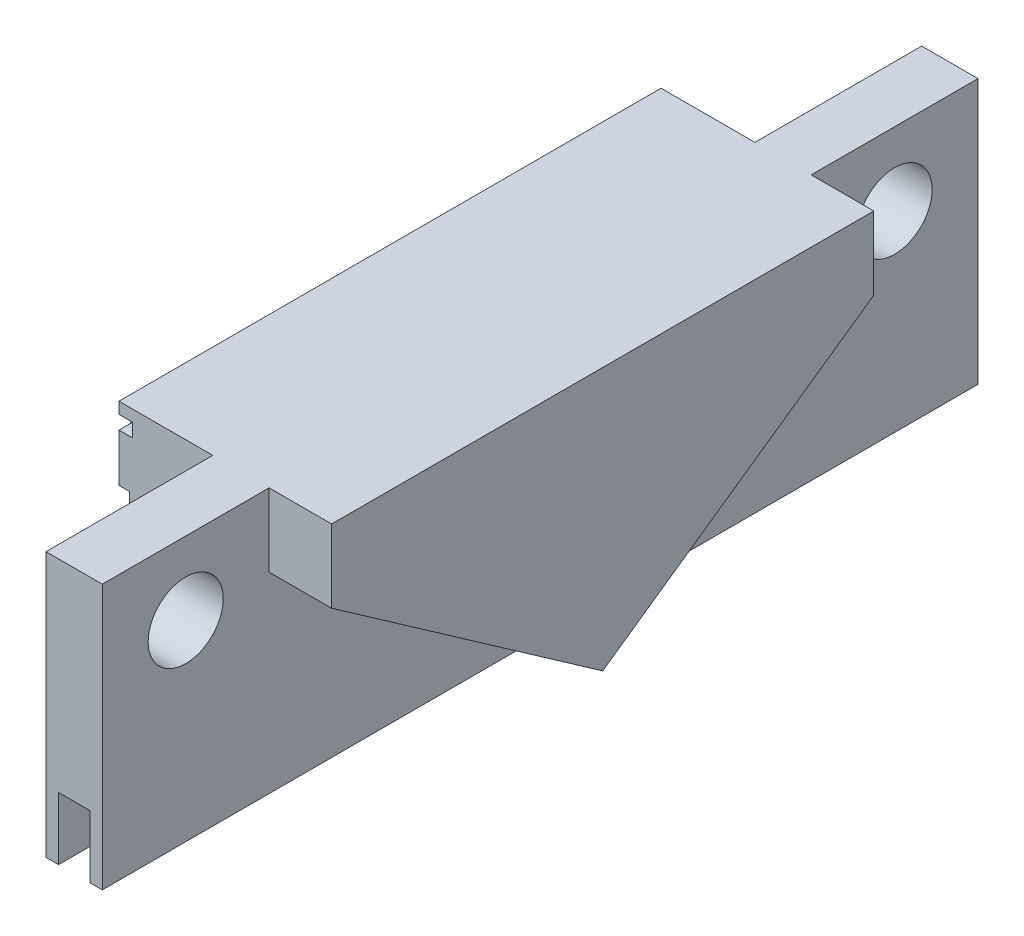
ISO-10303-21;
HEADER;
FILE_DESCRIPTION(('STEP AP214'),'2;1');
FILE_NAME('part.step','',(''),(''),'','','');
FILE_SCHEMA(('AUTOMOTIVE_DESIGN { 1 0 10303 214 1 1 1 1 }'));
ENDSEC;
DATA;
#1=APPLICATION_CONTEXT('core data for automotive mechanical design processes');
#2=APPLICATION_PROTOCOL_DEFINITION('international standard','automotive_design',2000,#1);
#3=PRODUCT_CONTEXT('',#1,'mechanical');
#4=PRODUCT('Part','Part','',(#3));
#5=PRODUCT_RELATED_PRODUCT_CATEGORY('part','',(#4));
#6=PRODUCT_DEFINITION_FORMATION('','',#4);
#7=PRODUCT_DEFINITION_CONTEXT('part definition',#1,'design');
#8=PRODUCT_DEFINITION('design','',#6,#7);
#9=PRODUCT_DEFINITION_SHAPE('','',#8);
#10=(LENGTH_UNIT() NAMED_UNIT(*) SI_UNIT(.MILLI.,.METRE.));
#11=(NAMED_UNIT(*) PLANE_ANGLE_UNIT() SI_UNIT($,.RADIAN.));
#12=(NAMED_UNIT(*) SI_UNIT($,.STERADIAN.) SOLID_ANGLE_UNIT());
#13=UNCERTAINTY_MEASURE_WITH_UNIT(LENGTH_MEASURE(1.E-05),#10,'distance_accuracy_value','');
#14=(GEOMETRIC_REPRESENTATION_CONTEXT(3) GLOBAL_UNCERTAINTY_ASSIGNED_CONTEXT((#13)) GLOBAL_UNIT_ASSIGNED_CONTEXT((#10,
#11,#12)) REPRESENTATION_CONTEXT('',''));
#15=CARTESIAN_POINT('',(0.,0.,0.));
#16=DIRECTION('',(0.,0.,1.));
#17=DIRECTION('',(1.,0.,0.));
#18=AXIS2_PLACEMENT_3D('',#15,#16,#17);
#19=CARTESIAN_POINT('',(0.,0.,0.));
#20=DIRECTION('',(0.,1.,0.));
#21=DIRECTION('',(0.,0.,1.));
#22=AXIS2_PLACEMENT_3D('',#19,#20,#21);
#23=PLANE('',#22);
#24=DIRECTION('',(0.,0.,1.));
#25=VECTOR('',#24,1.);
#26=CARTESIAN_POINT('',(-21.5781796503859,0.,0.));
#27=LINE('',#26,#25);
#28=CARTESIAN_POINT('',(-21.5781796503859,0.,-23.5441961802651));
#29=VERTEX_POINT('',#28);
#30=CARTESIAN_POINT('',(-21.5781796503859,0.,18.4558038197349));
#31=VERTEX_POINT('',#30);
#32=EDGE_CURVE('E426',#29,#31,#27,.T.);
#33=ORIENTED_EDGE('',*,*,#32,.T.);
#34=DIRECTION('',(1.,0.,0.));
#35=VECTOR('',#34,1.);
#36=CARTESIAN_POINT('',(0.,0.,18.4558038197349));
#37=LINE('',#36,#35);
#38=CARTESIAN_POINT('',(-22.1781796503859,0.,18.4558038197349));
#39=VERTEX_POINT('',#38);
#40=EDGE_CURVE('E326',#39,#31,#37,.T.);
#41=ORIENTED_EDGE('',*,*,#40,.F.);
#42=DIRECTION('',(0.,0.,1.));
#43=VECTOR('',#42,1.);
#44=CARTESIAN_POINT('',(-22.1781796503859,0.,4.45580381973494));
#45=LINE('',#44,#43);
#46=CARTESIAN_POINT('',(-22.1781796503859,0.,-23.5441961802651));
#47=VERTEX_POINT('',#46);
#48=EDGE_CURVE('E247',#47,#39,#45,.T.);
#49=ORIENTED_EDGE('',*,*,#48,.F.);
#50=DIRECTION('',(1.,0.,0.));
#51=VECTOR('',#50,1.);
#52=CARTESIAN_POINT('',(0.,0.,-23.5441961802651));
#53=LINE('',#52,#51);
#54=EDGE_CURVE('E440',#47,#29,#53,.T.);
#55=ORIENTED_EDGE('',*,*,#54,.T.);
#56=EDGE_LOOP('',(#33,#41,#49,#55));
#57=FACE_BOUND('',#56,.T.);
#58=ADVANCED_FACE('F45',(#57),#23,.F.);
#59=CARTESIAN_POINT('',(-28.7781796503859,-0.00999999999999959,18.4558038197349));
#60=DIRECTION('',(1.,0.,0.));
#61=DIRECTION('',(0.,0.,-1.));
#62=AXIS2_PLACEMENT_3D('',#59,#60,#61);
#63=PLANE('',#62);
#64=CARTESIAN_POINT('',(-28.7781796503859,9.2,-12.2941961802651));
#65=DIRECTION('',(1.,0.,0.));
#66=DIRECTION('',(0.,0.,-1.));
#67=AXIS2_PLACEMENT_3D('',#64,#65,#66);
#68=CIRCLE('',#67,1.6);
#69=CARTESIAN_POINT('',(-28.7781796503859,9.2,-13.8941961802651));
#70=VERTEX_POINT('',#69);
#71=EDGE_CURVE('E11',#70,#70,#68,.F.);
#72=ORIENTED_EDGE('',*,*,#71,.F.);
#73=EDGE_LOOP('',(#72));
#74=FACE_BOUND('',#73,.T.);
#75=DIRECTION('',(0.,-0.57357643635105,0.819152044288989));
#76=VECTOR('',#75,1.);
#77=CARTESIAN_POINT('',(-28.7781796503859,9.2,-15.5441961802651));
#78=LINE('',#77,#76);
#79=CARTESIAN_POINT('',(-28.7781796503859,9.2,-15.5441961802651));
#80=VERTEX_POINT('',#79);
#81=CARTESIAN_POINT('',(-28.7781796503859,0.0973020032736751,-2.54419618026506));
#82=VERTEX_POINT('',#81);
#83=EDGE_CURVE('E54',#80,#82,#78,.T.);
#84=ORIENTED_EDGE('',*,*,#83,.T.);
#85=DIRECTION('',(0.,-0.57357643635105,-0.819152044288989));
#86=VECTOR('',#85,1.);
#87=CARTESIAN_POINT('',(-28.7781796503859,9.2,10.4558038197349));
#88=LINE('',#87,#86);
#89=CARTESIAN_POINT('',(-28.7781796503859,9.2,10.4558038197349));
#90=VERTEX_POINT('',#89);
#91=EDGE_CURVE('E350',#90,#82,#88,.T.);
#92=ORIENTED_EDGE('',*,*,#91,.F.);
#93=DIRECTION('',(0.,-1.,0.));
#94=VECTOR('',#93,1.);
#95=CARTESIAN_POINT('',(-28.7781796503859,12.7,10.4558038197349));
#96=LINE('',#95,#94);
#97=CARTESIAN_POINT('',(-28.7781796503859,11.5,10.4558038197349));
#98=VERTEX_POINT('',#97);
#99=EDGE_CURVE('E346',#98,#90,#96,.T.);
#100=ORIENTED_EDGE('',*,*,#99,.F.);
#101=DIRECTION('',(0.,0.,-1.));
#102=VECTOR('',#101,1.);
#103=CARTESIAN_POINT('',(-28.7781796503859,11.5,10.4558038197349));
#104=LINE('',#103,#102);
#105=CARTESIAN_POINT('',(-28.7781796503859,11.5,0.455803819734919));
#106=VERTEX_POINT('',#105);
#107=EDGE_CURVE('E251',#98,#106,#104,.T.);
#108=ORIENTED_EDGE('',*,*,#107,.T.);
#109=DIRECTION('',(0.,1.,0.));
#110=VECTOR('',#109,1.);
#111=CARTESIAN_POINT('',(-28.7781796503859,11.5,0.455803819734919));
#112=LINE('',#111,#110);
#113=CARTESIAN_POINT('',(-28.7781796503859,12.15,0.455803819734919));
#114=VERTEX_POINT('',#113);
#115=EDGE_CURVE('E277',#106,#114,#112,.T.);
#116=ORIENTED_EDGE('',*,*,#115,.T.);
#117=DIRECTION('',(0.,0.,1.));
#118=VECTOR('',#117,1.);
#119=CARTESIAN_POINT('',(-28.7781796503859,12.15,10.4558038197349));
#120=LINE('',#119,#118);
#121=CARTESIAN_POINT('',(-28.7781796503859,12.15,10.4558038197349));
#122=VERTEX_POINT('',#121);
#123=EDGE_CURVE('E268',#114,#122,#120,.T.);
#124=ORIENTED_EDGE('',*,*,#123,.T.);
#125=CARTESIAN_POINT('',(-28.7781796503859,12.7,10.4558038197349));
#126=VERTEX_POINT('',#125);
#127=EDGE_CURVE('E347',#126,#122,#96,.T.);
#128=ORIENTED_EDGE('',*,*,#127,.F.);
#129=DIRECTION('',(0.,0.,-1.));
#130=VECTOR('',#129,1.);
#131=CARTESIAN_POINT('',(-28.7781796503859,12.7,0.));
#132=LINE('',#131,#130);
#133=CARTESIAN_POINT('',(-28.7781796503859,12.7,-15.5441961802651));
#134=VERTEX_POINT('',#133);
#135=EDGE_CURVE('E455',#126,#134,#132,.T.);
#136=ORIENTED_EDGE('',*,*,#135,.T.);
#137=DIRECTION('',(0.,-1.,0.));
#138=VECTOR('',#137,1.);
#139=CARTESIAN_POINT('',(-28.7781796503859,12.7,-15.5441961802651));
#140=LINE('',#139,#138);
#141=CARTESIAN_POINT('',(-28.7781796503859,12.15,-15.5441961802651));
#142=VERTEX_POINT('',#141);
#143=EDGE_CURVE('E457',#134,#142,#140,.T.);
#144=ORIENTED_EDGE('',*,*,#143,.T.);
#145=DIRECTION('',(0.,0.,-1.));
#146=VECTOR('',#145,1.);
#147=CARTESIAN_POINT('',(-28.7781796503859,12.15,-15.5441961802651));
#148=LINE('',#147,#146);
#149=CARTESIAN_POINT('',(-28.7781796503859,12.15,-5.54419618026507));
#150=VERTEX_POINT('',#149);
#151=EDGE_CURVE('E371',#150,#142,#148,.T.);
#152=ORIENTED_EDGE('',*,*,#151,.F.);
#153=DIRECTION('',(0.,1.,0.));
#154=VECTOR('',#153,1.);
#155=CARTESIAN_POINT('',(-28.7781796503859,11.5,-5.54419618026507));
#156=LINE('',#155,#154);
#157=CARTESIAN_POINT('',(-28.7781796503859,11.5,-5.54419618026507));
#158=VERTEX_POINT('',#157);
#159=EDGE_CURVE('E380',#158,#150,#156,.T.);
#160=ORIENTED_EDGE('',*,*,#159,.F.);
#161=DIRECTION('',(0.,0.,1.));
#162=VECTOR('',#161,1.);
#163=CARTESIAN_POINT('',(-28.7781796503859,11.5,-15.5441961802651));
#164=LINE('',#163,#162);
#165=CARTESIAN_POINT('',(-28.7781796503859,11.5,-15.5441961802651));
#166=VERTEX_POINT('',#165);
#167=EDGE_CURVE('E365',#166,#158,#164,.T.);
#168=ORIENTED_EDGE('',*,*,#167,.F.);
#169=EDGE_CURVE('E454',#166,#80,#140,.T.);
#170=ORIENTED_EDGE('',*,*,#169,.T.);
#171=EDGE_LOOP('',(#84,#92,#100,#108,#116,#124,#128,#136,#144,#152,#160,#168,#170));
#172=FACE_BOUND('',#171,.T.);
#173=CARTESIAN_POINT('',(-28.7781796503859,9.2,7.20580381973492));
#174=DIRECTION('',(-1.,0.,0.));
#175=DIRECTION('',(0.,0.,1.));
#176=AXIS2_PLACEMENT_3D('',#173,#174,#175);
#177=CIRCLE('',#176,1.6);
#178=CARTESIAN_POINT('',(-28.7781796503859,9.2,8.80580381973492));
#179=VERTEX_POINT('',#178);
#180=EDGE_CURVE('E353',#179,#179,#177,.F.);
#181=ORIENTED_EDGE('',*,*,#180,.T.);
#182=EDGE_LOOP('',(#181));
#183=FACE_BOUND('',#182,.T.);
#184=ADVANCED_FACE('F47',(#74,#172,#183),#63,.F.);
#185=DIRECTION('',(0.,0.,-1.));
#186=VECTOR('',#185,1.);
#187=CARTESIAN_POINT('',(-23.6781796503859,0.,4.45580381973494));
#188=LINE('',#187,#186);
#189=CARTESIAN_POINT('',(-23.6781796503859,0.,18.4558038197349));
#190=VERTEX_POINT('',#189);
#191=CARTESIAN_POINT('',(-23.6781796503859,0.,-23.5441961802651));
#192=VERTEX_POINT('',#191);
#193=EDGE_CURVE('E356',#190,#192,#188,.T.);
#194=ORIENTED_EDGE('',*,*,#193,.F.);
#195=CARTESIAN_POINT('',(-24.2781796503859,0.,18.4558038197349));
#196=VERTEX_POINT('',#195);
#197=EDGE_CURVE('E331',#196,#190,#37,.T.);
#198=ORIENTED_EDGE('',*,*,#197,.F.);
#199=DIRECTION('',(0.,0.,1.));
#200=VECTOR('',#199,1.);
#201=CARTESIAN_POINT('',(-24.2781796503859,0.,18.4558038197349));
#202=LINE('',#201,#200);
#203=CARTESIAN_POINT('',(-24.2781796503859,0.,10.4558038197349));
#204=VERTEX_POINT('',#203);
#205=EDGE_CURVE('E293',#204,#196,#202,.T.);
#206=ORIENTED_EDGE('',*,*,#205,.F.);
#207=DIRECTION('',(1.,0.,0.));
#208=VECTOR('',#207,1.);
#209=CARTESIAN_POINT('',(-28.2781796503859,0.,10.4558038197349));
#210=LINE('',#209,#208);
#211=CARTESIAN_POINT('',(-28.2781796503859,0.,10.4558038197349));
#212=VERTEX_POINT('',#211);
#213=EDGE_CURVE('E290',#212,#204,#210,.T.);
#214=ORIENTED_EDGE('',*,*,#213,.F.);
#215=DIRECTION('',(0.,0.,1.));
#216=VECTOR('',#215,1.);
#217=CARTESIAN_POINT('',(-28.2781796503859,0.,0.));
#218=LINE('',#217,#216);
#219=CARTESIAN_POINT('',(-28.2781796503859,0.,-15.5441961802651));
#220=VERTEX_POINT('',#219);
#221=EDGE_CURVE('E430',#220,#212,#218,.T.);
#222=ORIENTED_EDGE('',*,*,#221,.F.);
#223=DIRECTION('',(1.,0.,0.));
#224=VECTOR('',#223,1.);
#225=CARTESIAN_POINT('',(-28.2781796503859,0.,-15.5441961802651));
#226=LINE('',#225,#224);
#227=CARTESIAN_POINT('',(-24.2781796503859,0.,-15.5441961802651));
#228=VERTEX_POINT('',#227);
#229=EDGE_CURVE('E393',#220,#228,#226,.T.);
#230=ORIENTED_EDGE('',*,*,#229,.T.);
#231=DIRECTION('',(0.,0.,-1.));
#232=VECTOR('',#231,1.);
#233=CARTESIAN_POINT('',(-24.2781796503859,0.,-23.5441961802651));
#234=LINE('',#233,#232);
#235=CARTESIAN_POINT('',(-24.2781796503859,0.,-23.5441961802651));
#236=VERTEX_POINT('',#235);
#237=EDGE_CURVE('E396',#228,#236,#234,.T.);
#238=ORIENTED_EDGE('',*,*,#237,.T.);
#239=EDGE_CURVE('E441',#236,#192,#53,.T.);
#240=ORIENTED_EDGE('',*,*,#239,.T.);
#241=EDGE_LOOP('',(#194,#198,#206,#214,#222,#230,#238,#240));
#242=FACE_BOUND('',#241,.T.);
#243=ADVANCED_FACE('F511',(#242),#23,.F.);
#244=CARTESIAN_POINT('',(0.,12.7,-15.5441961802651));
#245=DIRECTION('',(0.,0.,-1.));
#246=DIRECTION('',(-1.,0.,0.));
#247=AXIS2_PLACEMENT_3D('',#244,#245,#246);
#248=PLANE('',#247);
#249=DIRECTION('',(-1.,0.,0.));
#250=VECTOR('',#249,1.);
#251=CARTESIAN_POINT('',(-28.1281796503859,12.15,-15.5441961802651));
#252=LINE('',#251,#250);
#253=CARTESIAN_POINT('',(-28.1281796503859,12.15,-15.5441961802651));
#254=VERTEX_POINT('',#253);
#255=EDGE_CURVE('E384',#254,#142,#252,.T.);
#256=ORIENTED_EDGE('',*,*,#255,.T.);
#257=ORIENTED_EDGE('',*,*,#143,.F.);
#258=DIRECTION('',(1.,0.,0.));
#259=VECTOR('',#258,1.);
#260=CARTESIAN_POINT('',(0.,12.7,-15.5441961802651));
#261=LINE('',#260,#259);
#262=CARTESIAN_POINT('',(-24.2781796503859,12.7,-15.5441961802651));
#263=VERTEX_POINT('',#262);
#264=EDGE_CURVE('E434',#134,#263,#261,.T.);
#265=ORIENTED_EDGE('',*,*,#264,.T.);
#266=DIRECTION('',(0.,1.,0.));
#267=VECTOR('',#266,1.);
#268=CARTESIAN_POINT('',(-24.2781796503859,0.,-15.5441961802651));
#269=LINE('',#268,#267);
#270=EDGE_CURVE('E404',#228,#263,#269,.T.);
#271=ORIENTED_EDGE('',*,*,#270,.F.);
#272=ORIENTED_EDGE('',*,*,#229,.F.);
#273=DIRECTION('',(0.,1.,0.));
#274=VECTOR('',#273,1.);
#275=CARTESIAN_POINT('',(-28.2781796503859,0.,-15.5441961802651));
#276=LINE('',#275,#274);
#277=CARTESIAN_POINT('',(-28.2781796503859,9.2,-15.5441961802651));
#278=VERTEX_POINT('',#277);
#279=EDGE_CURVE('E399',#220,#278,#276,.T.);
#280=ORIENTED_EDGE('',*,*,#279,.T.);
#281=DIRECTION('',(-1.,0.,0.));
#282=VECTOR('',#281,1.);
#283=CARTESIAN_POINT('',(-28.2781796503859,9.2,-15.5441961802651));
#284=LINE('',#283,#282);
#285=EDGE_CURVE('E413',#278,#80,#284,.T.);
#286=ORIENTED_EDGE('',*,*,#285,.T.);
#287=ORIENTED_EDGE('',*,*,#169,.F.);
#288=DIRECTION('',(-1.,0.,0.));
#289=VECTOR('',#288,1.);
#290=CARTESIAN_POINT('',(-28.1281796503859,11.5,-15.5441961802651));
#291=LINE('',#290,#289);
#292=CARTESIAN_POINT('',(-28.1281796503859,11.5,-15.5441961802651));
#293=VERTEX_POINT('',#292);
#294=EDGE_CURVE('E377',#293,#166,#291,.T.);
#295=ORIENTED_EDGE('',*,*,#294,.F.);
#296=DIRECTION('',(0.,-1.,0.));
#297=VECTOR('',#296,1.);
#298=CARTESIAN_POINT('',(-28.1281796503859,11.5,-15.5441961802651));
#299=LINE('',#298,#297);
#300=EDGE_CURVE('E368',#254,#293,#299,.T.);
#301=ORIENTED_EDGE('',*,*,#300,.F.);
#302=EDGE_LOOP('',(#256,#257,#265,#271,#272,#280,#286,#287,#295,#301));
#303=FACE_BOUND('',#302,.T.);
#304=ADVANCED_FACE('F503',(#303),#248,.T.);
#305=CARTESIAN_POINT('',(-18.5781796503859,12.7,0.));
#306=DIRECTION('',(1.,0.,0.));
#307=DIRECTION('',(0.,0.,-1.));
#308=AXIS2_PLACEMENT_3D('',#305,#306,#307);
#309=PLANE('',#308);
#310=DIRECTION('',(0.,0.,1.));
#311=VECTOR('',#310,1.);
#312=CARTESIAN_POINT('',(-18.5781796503859,12.7,0.));
#313=LINE('',#312,#311);
#314=CARTESIAN_POINT('',(-18.5781796503859,12.7,-15.5441961802651));
#315=VERTEX_POINT('',#314);
#316=CARTESIAN_POINT('',(-18.5781796503859,12.7,10.4558038197349));
#317=VERTEX_POINT('',#316);
#318=EDGE_CURVE('E427',#315,#317,#313,.T.);
#319=ORIENTED_EDGE('',*,*,#318,.T.);
#320=DIRECTION('',(0.,-1.,0.));
#321=VECTOR('',#320,1.);
#322=CARTESIAN_POINT('',(-18.5781796503859,12.7,10.4558038197349));
#323=LINE('',#322,#321);
#324=CARTESIAN_POINT('',(-18.5781796503859,9.2,10.4558038197349));
#325=VERTEX_POINT('',#324);
#326=EDGE_CURVE('E343',#317,#325,#323,.T.);
#327=ORIENTED_EDGE('',*,*,#326,.T.);
#328=DIRECTION('',(0.,-0.57357643635105,-0.819152044288989));
#329=VECTOR('',#328,1.);
#330=CARTESIAN_POINT('',(-18.5781796503859,9.2,10.4558038197349));
#331=LINE('',#330,#329);
#332=CARTESIAN_POINT('',(-18.5781796503859,0.097302003273677,-2.54419618026507));
#333=VERTEX_POINT('',#332);
#334=EDGE_CURVE('E318',#325,#333,#331,.T.);
#335=ORIENTED_EDGE('',*,*,#334,.T.);
#336=DIRECTION('',(0.,-0.57357643635105,0.819152044288989));
#337=VECTOR('',#336,1.);
#338=CARTESIAN_POINT('',(-18.5781796503859,9.2,-15.5441961802651));
#339=LINE('',#338,#337);
#340=CARTESIAN_POINT('',(-18.5781796503859,9.2,-15.5441961802651));
#341=VERTEX_POINT('',#340);
#342=EDGE_CURVE('E419',#341,#333,#339,.T.);
#343=ORIENTED_EDGE('',*,*,#342,.F.);
#344=DIRECTION('',(0.,-1.,0.));
#345=VECTOR('',#344,1.);
#346=CARTESIAN_POINT('',(-18.5781796503859,12.7,-15.5441961802651));
#347=LINE('',#346,#345);
#348=EDGE_CURVE('E451',#315,#341,#347,.T.);
#349=ORIENTED_EDGE('',*,*,#348,.F.);
#350=EDGE_LOOP('',(#319,#327,#335,#343,#349));
#351=FACE_BOUND('',#350,.T.);
#352=ADVANCED_FACE('F553',(#351),#309,.T.);
#353=DIRECTION('',(1.,0.,0.));
#354=VECTOR('',#353,1.);
#355=CARTESIAN_POINT('',(-21.5781796503859,9.2,-15.5441961802651));
#356=LINE('',#355,#354);
#357=CARTESIAN_POINT('',(-21.5781796503859,9.2,-15.5441961802651));
#358=VERTEX_POINT('',#357);
#359=EDGE_CURVE('E416',#358,#341,#356,.T.);
#360=ORIENTED_EDGE('',*,*,#359,.F.);
#361=DIRECTION('',(0.,-1.,0.));
#362=VECTOR('',#361,1.);
#363=CARTESIAN_POINT('',(-21.5781796503859,12.7,-15.5441961802651));
#364=LINE('',#363,#362);
#365=CARTESIAN_POINT('',(-21.5781796503859,12.7,-15.5441961802651));
#366=VERTEX_POINT('',#365);
#367=EDGE_CURVE('E448',#366,#358,#364,.T.);
#368=ORIENTED_EDGE('',*,*,#367,.F.);
#369=EDGE_CURVE('E429',#366,#315,#261,.T.);
#370=ORIENTED_EDGE('',*,*,#369,.T.);
#371=ORIENTED_EDGE('',*,*,#348,.T.);
#372=EDGE_LOOP('',(#360,#368,#370,#371));
#373=FACE_BOUND('',#372,.T.);
#374=ADVANCED_FACE('F554',(#373),#248,.T.);
#375=CARTESIAN_POINT('',(-21.5781796503859,12.7,0.));
#376=DIRECTION('',(1.,0.,0.));
#377=DIRECTION('',(0.,0.,-1.));
#378=AXIS2_PLACEMENT_3D('',#375,#376,#377);
#379=PLANE('',#378);
#380=DIRECTION('',(0.,-0.57357643635105,0.819152044288989));
#381=VECTOR('',#380,1.);
#382=CARTESIAN_POINT('',(-21.5781796503859,9.2,-15.5441961802651));
#383=LINE('',#382,#381);
#384=CARTESIAN_POINT('',(-21.5781796503859,0.0973020032736787,-2.54419618026507));
#385=VERTEX_POINT('',#384);
#386=EDGE_CURVE('E418',#358,#385,#383,.T.);
#387=ORIENTED_EDGE('',*,*,#386,.T.);
#388=DIRECTION('',(0.,-0.57357643635105,-0.819152044288989));
#389=VECTOR('',#388,1.);
#390=CARTESIAN_POINT('',(-21.5781796503859,9.2,10.4558038197349));
#391=LINE('',#390,#389);
#392=CARTESIAN_POINT('',(-21.5781796503859,9.2,10.4558038197349));
#393=VERTEX_POINT('',#392);
#394=EDGE_CURVE('E317',#393,#385,#391,.T.);
#395=ORIENTED_EDGE('',*,*,#394,.F.);
#396=DIRECTION('',(0.,-1.,0.));
#397=VECTOR('',#396,1.);
#398=CARTESIAN_POINT('',(-21.5781796503859,12.7,10.4558038197349));
#399=LINE('',#398,#397);
#400=CARTESIAN_POINT('',(-21.5781796503859,12.7,10.4558038197349));
#401=VERTEX_POINT('',#400);
#402=EDGE_CURVE('E340',#401,#393,#399,.T.);
#403=ORIENTED_EDGE('',*,*,#402,.F.);
#404=DIRECTION('',(0.,0.,-1.));
#405=VECTOR('',#404,1.);
#406=CARTESIAN_POINT('',(-21.5781796503859,12.7,-5.08839236053016));
#407=LINE('',#406,#405);
#408=CARTESIAN_POINT('',(-21.5781796503859,12.7,18.4558038197349));
#409=VERTEX_POINT('',#408);
#410=EDGE_CURVE('E330',#409,#401,#407,.T.);
#411=ORIENTED_EDGE('',*,*,#410,.F.);
#412=DIRECTION('',(0.,-1.,0.));
#413=VECTOR('',#412,1.);
#414=CARTESIAN_POINT('',(-21.5781796503859,12.7,18.4558038197349));
#415=LINE('',#414,#413);
#416=EDGE_CURVE('E337',#409,#31,#415,.T.);
#417=ORIENTED_EDGE('',*,*,#416,.T.);
#418=ORIENTED_EDGE('',*,*,#32,.F.);
#419=DIRECTION('',(0.,-1.,0.));
#420=VECTOR('',#419,1.);
#421=CARTESIAN_POINT('',(-21.5781796503859,12.7,-23.5441961802651));
#422=LINE('',#421,#420);
#423=CARTESIAN_POINT('',(-21.5781796503859,12.7,-23.5441961802651));
#424=VERTEX_POINT('',#423);
#425=EDGE_CURVE('E445',#424,#29,#422,.T.);
#426=ORIENTED_EDGE('',*,*,#425,.F.);
#427=DIRECTION('',(0.,0.,1.));
#428=VECTOR('',#427,1.);
#429=CARTESIAN_POINT('',(-21.5781796503859,12.7,0.));
#430=LINE('',#429,#428);
#431=EDGE_CURVE('E433',#424,#366,#430,.T.);
#432=ORIENTED_EDGE('',*,*,#431,.T.);
#433=ORIENTED_EDGE('',*,*,#367,.T.);
#434=EDGE_LOOP('',(#387,#395,#403,#411,#417,#418,#426,#432,#433));
#435=FACE_BOUND('',#434,.T.);
#436=CARTESIAN_POINT('',(-21.5781796503859,9.2,-19.5441961802651));
#437=DIRECTION('',(1.,0.,0.));
#438=DIRECTION('',(0.,0.,-1.));
#439=AXIS2_PLACEMENT_3D('',#436,#437,#438);
#440=CIRCLE('',#439,1.8);
#441=CARTESIAN_POINT('',(-21.5781796503859,9.2,-21.3441961802651));
#442=VERTEX_POINT('',#441);
#443=EDGE_CURVE('E421',#442,#442,#440,.T.);
#444=ORIENTED_EDGE('',*,*,#443,.F.);
#445=EDGE_LOOP('',(#444));
#446=FACE_BOUND('',#445,.T.);
#447=CARTESIAN_POINT('',(-21.5781796503859,9.2,14.4558038197349));
#448=DIRECTION('',(-1.,0.,0.));
#449=DIRECTION('',(0.,0.,1.));
#450=AXIS2_PLACEMENT_3D('',#447,#448,#449);
#451=CIRCLE('',#450,1.8);
#452=CARTESIAN_POINT('',(-21.5781796503859,9.2,16.2558038197349));
#453=VERTEX_POINT('',#452);
#454=EDGE_CURVE('E321',#453,#453,#451,.T.);
#455=ORIENTED_EDGE('',*,*,#454,.T.);
#456=EDGE_LOOP('',(#455));
#457=FACE_BOUND('',#456,.T.);
#458=ADVANCED_FACE('F586',(#435,#446,#457),#379,.T.);
#459=CARTESIAN_POINT('',(0.,12.7,-23.5441961802651));
#460=DIRECTION('',(0.,0.,-1.));
#461=DIRECTION('',(-1.,0.,0.));
#462=AXIS2_PLACEMENT_3D('',#459,#460,#461);
#463=PLANE('',#462);
#464=DIRECTION('',(0.,-1.,0.));
#465=VECTOR('',#464,1.);
#466=CARTESIAN_POINT('',(-23.6781796503859,3.,-23.5441961802651));
#467=LINE('',#466,#465);
#468=CARTESIAN_POINT('',(-23.6781796503859,3.,-23.5441961802651));
#469=VERTEX_POINT('',#468);
#470=EDGE_CURVE('E241',#469,#192,#467,.T.);
#471=ORIENTED_EDGE('',*,*,#470,.T.);
#472=ORIENTED_EDGE('',*,*,#239,.F.);
#473=DIRECTION('',(0.,1.,0.));
#474=VECTOR('',#473,1.);
#475=CARTESIAN_POINT('',(-24.2781796503859,0.,-23.5441961802651));
#476=LINE('',#475,#474);
#477=CARTESIAN_POINT('',(-24.2781796503859,12.7,-23.5441961802651));
#478=VERTEX_POINT('',#477);
#479=EDGE_CURVE('E401',#236,#478,#476,.T.);
#480=ORIENTED_EDGE('',*,*,#479,.T.);
#481=DIRECTION('',(1.,0.,0.));
#482=VECTOR('',#481,1.);
#483=CARTESIAN_POINT('',(0.,12.7,-23.5441961802651));
#484=LINE('',#483,#482);
#485=EDGE_CURVE('E437',#478,#424,#484,.T.);
#486=ORIENTED_EDGE('',*,*,#485,.T.);
#487=ORIENTED_EDGE('',*,*,#425,.T.);
#488=ORIENTED_EDGE('',*,*,#54,.F.);
#489=DIRECTION('',(0.,-1.,0.));
#490=VECTOR('',#489,1.);
#491=CARTESIAN_POINT('',(-22.1781796503859,3.,-23.5441961802651));
#492=LINE('',#491,#490);
#493=CARTESIAN_POINT('',(-22.1781796503859,3.,-23.5441961802651));
#494=VERTEX_POINT('',#493);
#495=EDGE_CURVE('E363',#494,#47,#492,.T.);
#496=ORIENTED_EDGE('',*,*,#495,.F.);
#497=DIRECTION('',(1.,0.,0.));
#498=VECTOR('',#497,1.);
#499=CARTESIAN_POINT('',(-23.6781796503859,3.,-23.5441961802651));
#500=LINE('',#499,#498);
#501=EDGE_CURVE('E238',#469,#494,#500,.T.);
#502=ORIENTED_EDGE('',*,*,#501,.F.);
#503=EDGE_LOOP('',(#471,#472,#480,#486,#487,#488,#496,#502));
#504=FACE_BOUND('',#503,.T.);
#505=ADVANCED_FACE('F581',(#504),#463,.T.);
#506=CARTESIAN_POINT('',(-28.2781796503859,12.7,0.));
#507=DIRECTION('',(1.,0.,0.));
#508=DIRECTION('',(0.,0.,-1.));
#509=AXIS2_PLACEMENT_3D('',#506,#507,#508);
#510=PLANE('',#509);
#511=ORIENTED_EDGE('',*,*,#221,.T.);
#512=DIRECTION('',(0.,1.,0.));
#513=VECTOR('',#512,1.);
#514=CARTESIAN_POINT('',(-28.2781796503859,0.,10.4558038197349));
#515=LINE('',#514,#513);
#516=CARTESIAN_POINT('',(-28.2781796503859,9.2,10.4558038197349));
#517=VERTEX_POINT('',#516);
#518=EDGE_CURVE('E296',#212,#517,#515,.T.);
#519=ORIENTED_EDGE('',*,*,#518,.T.);
#520=DIRECTION('',(0.,-0.57357643635105,-0.819152044288989));
#521=VECTOR('',#520,1.);
#522=CARTESIAN_POINT('',(-28.2781796503859,9.2,10.4558038197349));
#523=LINE('',#522,#521);
#524=CARTESIAN_POINT('',(-28.2781796503859,0.0973020032736752,-2.54419618026506));
#525=VERTEX_POINT('',#524);
#526=EDGE_CURVE('E310',#517,#525,#523,.T.);
#527=ORIENTED_EDGE('',*,*,#526,.T.);
#528=DIRECTION('',(0.,-0.57357643635105,0.819152044288989));
#529=VECTOR('',#528,1.);
#530=CARTESIAN_POINT('',(-28.2781796503859,9.2,-15.5441961802651));
#531=LINE('',#530,#529);
#532=EDGE_CURVE('E411',#278,#525,#531,.T.);
#533=ORIENTED_EDGE('',*,*,#532,.F.);
#534=ORIENTED_EDGE('',*,*,#279,.F.);
#535=EDGE_LOOP('',(#511,#519,#527,#533,#534));
#536=FACE_BOUND('',#535,.T.);
#537=ADVANCED_FACE('F516',(#536),#510,.F.);
#538=CARTESIAN_POINT('',(0.,12.7,0.));
#539=DIRECTION('',(0.,1.,0.));
#540=DIRECTION('',(0.,0.,1.));
#541=AXIS2_PLACEMENT_3D('',#538,#539,#540);
#542=PLANE('',#541);
#543=ORIENTED_EDGE('',*,*,#135,.F.);
#544=DIRECTION('',(1.,0.,0.));
#545=VECTOR('',#544,1.);
#546=CARTESIAN_POINT('',(0.,12.7,10.4558038197349));
#547=LINE('',#546,#545);
#548=CARTESIAN_POINT('',(-24.2781796503859,12.7,10.4558038197349));
#549=VERTEX_POINT('',#548);
#550=EDGE_CURVE('E332',#126,#549,#547,.T.);
#551=ORIENTED_EDGE('',*,*,#550,.T.);
#552=DIRECTION('',(0.,0.,1.));
#553=VECTOR('',#552,1.);
#554=CARTESIAN_POINT('',(-24.2781796503859,12.7,18.4558038197349));
#555=LINE('',#554,#553);
#556=CARTESIAN_POINT('',(-24.2781796503859,12.7,18.4558038197349));
#557=VERTEX_POINT('',#556);
#558=EDGE_CURVE('E284',#549,#557,#555,.T.);
#559=ORIENTED_EDGE('',*,*,#558,.T.);
#560=DIRECTION('',(1.,0.,0.));
#561=VECTOR('',#560,1.);
#562=CARTESIAN_POINT('',(0.,12.7,18.4558038197349));
#563=LINE('',#562,#561);
#564=EDGE_CURVE('E334',#557,#409,#563,.T.);
#565=ORIENTED_EDGE('',*,*,#564,.T.);
#566=ORIENTED_EDGE('',*,*,#410,.T.);
#567=EDGE_CURVE('E327',#401,#317,#547,.T.);
#568=ORIENTED_EDGE('',*,*,#567,.T.);
#569=ORIENTED_EDGE('',*,*,#318,.F.);
#570=ORIENTED_EDGE('',*,*,#369,.F.);
#571=ORIENTED_EDGE('',*,*,#431,.F.);
#572=ORIENTED_EDGE('',*,*,#485,.F.);
#573=DIRECTION('',(0.,0.,-1.));
#574=VECTOR('',#573,1.);
#575=CARTESIAN_POINT('',(-24.2781796503859,12.7,-23.5441961802651));
#576=LINE('',#575,#574);
#577=EDGE_CURVE('E387',#263,#478,#576,.T.);
#578=ORIENTED_EDGE('',*,*,#577,.F.);
#579=ORIENTED_EDGE('',*,*,#264,.F.);
#580=EDGE_LOOP('',(#543,#551,#559,#565,#566,#568,#569,#570,#571,#572,#578,#579));
#581=FACE_BOUND('',#580,.T.);
#582=ADVANCED_FACE('F498',(#581),#542,.T.);
#583=CARTESIAN_POINT('',(-31.2781796503859,9.2,-19.5441961802651));
#584=DIRECTION('',(1.,0.,0.));
#585=DIRECTION('',(0.,0.,-1.));
#586=AXIS2_PLACEMENT_3D('',#583,#584,#585);
#587=CYLINDRICAL_SURFACE('',#586,1.8);
#588=CARTESIAN_POINT('',(-24.2781796503859,9.2,-19.5441961802651));
#589=DIRECTION('',(1.,0.,0.));
#590=DIRECTION('',(0.,0.,-1.));
#591=AXIS2_PLACEMENT_3D('',#588,#589,#590);
#592=CIRCLE('',#591,1.8);
#593=CARTESIAN_POINT('',(-24.2781796503859,9.2,-21.3441961802651));
#594=VERTEX_POINT('',#593);
#595=EDGE_CURVE('E49',#594,#594,#592,.F.);
#596=ORIENTED_EDGE('',*,*,#595,.T.);
#597=EDGE_LOOP('',(#596));
#598=FACE_BOUND('',#597,.T.);
#599=ORIENTED_EDGE('',*,*,#443,.T.);
#600=EDGE_LOOP('',(#599));
#601=FACE_BOUND('',#600,.T.);
#602=ADVANCED_FACE('F573',(#598,#601),#587,.F.);
#603=CARTESIAN_POINT('',(-21.5781796503859,9.2,-15.5441961802651));
#604=DIRECTION('',(0.,0.819152044288989,0.57357643635105));
#605=DIRECTION('',(0.,-0.57357643635105,0.819152044288989));
#606=AXIS2_PLACEMENT_3D('',#603,#604,#605);
#607=PLANE('',#606);
#608=ORIENTED_EDGE('',*,*,#342,.T.);
#609=DIRECTION('',(-1.,0.,0.));
#610=VECTOR('',#609,1.);
#611=CARTESIAN_POINT('',(-21.5781796503859,0.0973020032736787,-2.54419618026508));
#612=LINE('',#611,#610);
#613=EDGE_CURVE('E257',#333,#385,#612,.T.);
#614=ORIENTED_EDGE('',*,*,#613,.T.);
#615=ORIENTED_EDGE('',*,*,#386,.F.);
#616=ORIENTED_EDGE('',*,*,#359,.T.);
#617=EDGE_LOOP('',(#608,#614,#615,#616));
#618=FACE_BOUND('',#617,.T.);
#619=ADVANCED_FACE('F565',(#618),#607,.F.);
#620=CARTESIAN_POINT('',(-28.2781796503859,9.2,-15.5441961802651));
#621=DIRECTION('',(0.,-0.819152044288989,-0.57357643635105));
#622=DIRECTION('',(0.,0.57357643635105,-0.819152044288989));
#623=AXIS2_PLACEMENT_3D('',#620,#621,#622);
#624=PLANE('',#623);
#625=DIRECTION('',(1.,0.,0.));
#626=VECTOR('',#625,1.);
#627=CARTESIAN_POINT('',(-28.2781796503859,0.0973020032736752,-2.54419618026509));
#628=LINE('',#627,#626);
#629=EDGE_CURVE('E260',#82,#525,#628,.T.);
#630=ORIENTED_EDGE('',*,*,#629,.F.);
#631=ORIENTED_EDGE('',*,*,#83,.F.);
#632=ORIENTED_EDGE('',*,*,#285,.F.);
#633=ORIENTED_EDGE('',*,*,#532,.T.);
#634=EDGE_LOOP('',(#630,#631,#632,#633));
#635=FACE_BOUND('',#634,.T.);
#636=ADVANCED_FACE('F517',(#635),#624,.T.);
#637=CARTESIAN_POINT('',(-30.1781796503859,9.2,-12.2941961802651));
#638=DIRECTION('',(1.,0.,0.));
#639=DIRECTION('',(0.,0.,-1.));
#640=AXIS2_PLACEMENT_3D('',#637,#638,#639);
#641=CYLINDRICAL_SURFACE('',#640,1.6);
#642=CARTESIAN_POINT('',(-30.1781796503859,9.2,-12.2941961802651));
#643=DIRECTION('',(-1.,0.,0.));
#644=DIRECTION('',(0.,0.,-1.));
#645=AXIS2_PLACEMENT_3D('',#642,#643,#644);
#646=CIRCLE('',#645,1.6);
#647=CARTESIAN_POINT('',(-30.1781796503859,9.2,-13.8941961802651));
#648=VERTEX_POINT('',#647);
#649=EDGE_CURVE('E408',#648,#648,#646,.T.);
#650=ORIENTED_EDGE('',*,*,#649,.F.);
#651=EDGE_LOOP('',(#650));
#652=FACE_BOUND('',#651,.T.);
#653=ORIENTED_EDGE('',*,*,#71,.T.);
#654=EDGE_LOOP('',(#653));
#655=FACE_BOUND('',#654,.T.);
#656=ADVANCED_FACE('F549',(#652,#655),#641,.T.);
#657=CARTESIAN_POINT('',(-30.1781796503859,9.2,-12.2941961802651));
#658=DIRECTION('',(1.,0.,0.));
#659=DIRECTION('',(0.,0.,-1.));
#660=AXIS2_PLACEMENT_3D('',#657,#658,#659);
#661=PLANE('',#660);
#662=ORIENTED_EDGE('',*,*,#649,.T.);
#663=EDGE_LOOP('',(#662));
#664=FACE_BOUND('',#663,.T.);
#665=ADVANCED_FACE('F556',(#664),#661,.F.);
#666=CARTESIAN_POINT('',(-24.2781796503859,0.,-23.5441961802651));
#667=DIRECTION('',(1.,0.,0.));
#668=DIRECTION('',(0.,0.,-1.));
#669=AXIS2_PLACEMENT_3D('',#666,#667,#668);
#670=PLANE('',#669);
#671=ORIENTED_EDGE('',*,*,#577,.T.);
#672=ORIENTED_EDGE('',*,*,#479,.F.);
#673=ORIENTED_EDGE('',*,*,#237,.F.);
#674=ORIENTED_EDGE('',*,*,#270,.T.);
#675=EDGE_LOOP('',(#671,#672,#673,#674));
#676=FACE_BOUND('',#675,.T.);
#677=ORIENTED_EDGE('',*,*,#595,.F.);
#678=EDGE_LOOP('',(#677));
#679=FACE_BOUND('',#678,.T.);
#680=ADVANCED_FACE('F506',(#676,#679),#670,.F.);
#681=CARTESIAN_POINT('',(-28.1281796503859,12.15,-15.5441961802651));
#682=DIRECTION('',(0.,1.,0.));
#683=DIRECTION('',(0.,0.,1.));
#684=AXIS2_PLACEMENT_3D('',#681,#682,#683);
#685=PLANE('',#684);
#686=ORIENTED_EDGE('',*,*,#151,.T.);
#687=ORIENTED_EDGE('',*,*,#255,.F.);
#688=DIRECTION('',(0.,0.,-1.));
#689=VECTOR('',#688,1.);
#690=CARTESIAN_POINT('',(-28.1281796503859,12.15,-15.5441961802651));
#691=LINE('',#690,#689);
#692=CARTESIAN_POINT('',(-28.1281796503859,12.15,-5.54419618026507));
#693=VERTEX_POINT('',#692);
#694=EDGE_CURVE('E69',#693,#254,#691,.T.);
#695=ORIENTED_EDGE('',*,*,#694,.F.);
#696=DIRECTION('',(-1.,0.,0.));
#697=VECTOR('',#696,1.);
#698=CARTESIAN_POINT('',(-28.1281796503859,12.15,-5.54419618026507));
#699=LINE('',#698,#697);
#700=EDGE_CURVE('E388',#693,#150,#699,.T.);
#701=ORIENTED_EDGE('',*,*,#700,.T.);
#702=EDGE_LOOP('',(#686,#687,#695,#701));
#703=FACE_BOUND('',#702,.T.);
#704=ADVANCED_FACE('F916',(#703),#685,.F.);
#705=CARTESIAN_POINT('',(-28.1281796503859,11.5,-5.54419618026507));
#706=DIRECTION('',(0.,0.,1.));
#707=DIRECTION('',(1.,0.,0.));
#708=AXIS2_PLACEMENT_3D('',#705,#706,#707);
#709=PLANE('',#708);
#710=ORIENTED_EDGE('',*,*,#159,.T.);
#711=ORIENTED_EDGE('',*,*,#700,.F.);
#712=DIRECTION('',(0.,1.,0.));
#713=VECTOR('',#712,1.);
#714=CARTESIAN_POINT('',(-28.1281796503859,11.5,-5.54419618026507));
#715=LINE('',#714,#713);
#716=CARTESIAN_POINT('',(-28.1281796503859,11.5,-5.54419618026507));
#717=VERTEX_POINT('',#716);
#718=EDGE_CURVE('E374',#717,#693,#715,.T.);
#719=ORIENTED_EDGE('',*,*,#718,.F.);
#720=DIRECTION('',(-1.,0.,0.));
#721=VECTOR('',#720,1.);
#722=CARTESIAN_POINT('',(-28.1281796503859,11.5,-5.54419618026507));
#723=LINE('',#722,#721);
#724=EDGE_CURVE('E390',#717,#158,#723,.T.);
#725=ORIENTED_EDGE('',*,*,#724,.T.);
#726=EDGE_LOOP('',(#710,#711,#719,#725));
#727=FACE_BOUND('',#726,.T.);
#728=ADVANCED_FACE('F525',(#727),#709,.F.);
#729=CARTESIAN_POINT('',(-28.1281796503859,11.5,-15.5441961802651));
#730=DIRECTION('',(0.,-1.,0.));
#731=DIRECTION('',(0.,0.,-1.));
#732=AXIS2_PLACEMENT_3D('',#729,#730,#731);
#733=PLANE('',#732);
#734=ORIENTED_EDGE('',*,*,#167,.T.);
#735=ORIENTED_EDGE('',*,*,#724,.F.);
#736=DIRECTION('',(0.,0.,1.));
#737=VECTOR('',#736,1.);
#738=CARTESIAN_POINT('',(-28.1281796503859,11.5,-15.5441961802651));
#739=LINE('',#738,#737);
#740=EDGE_CURVE('E370',#293,#717,#739,.T.);
#741=ORIENTED_EDGE('',*,*,#740,.F.);
#742=ORIENTED_EDGE('',*,*,#294,.T.);
#743=EDGE_LOOP('',(#734,#735,#741,#742));
#744=FACE_BOUND('',#743,.T.);
#745=ADVANCED_FACE('F521',(#744),#733,.F.);
#746=CARTESIAN_POINT('',(-28.1281796503859,0.,0.));
#747=DIRECTION('',(1.,0.,0.));
#748=DIRECTION('',(0.,0.,-1.));
#749=AXIS2_PLACEMENT_3D('',#746,#747,#748);
#750=PLANE('',#749);
#751=ORIENTED_EDGE('',*,*,#300,.T.);
#752=ORIENTED_EDGE('',*,*,#740,.T.);
#753=ORIENTED_EDGE('',*,*,#718,.T.);
#754=ORIENTED_EDGE('',*,*,#694,.T.);
#755=EDGE_LOOP('',(#751,#752,#753,#754));
#756=FACE_BOUND('',#755,.T.);
#757=ADVANCED_FACE('F527',(#756),#750,.F.);
#758=CARTESIAN_POINT('',(-23.6781796503859,3.,4.45580381973494));
#759=DIRECTION('',(-1.,0.,0.));
#760=DIRECTION('',(0.,0.,1.));
#761=AXIS2_PLACEMENT_3D('',#758,#759,#760);
#762=PLANE('',#761);
#763=DIRECTION('',(0.,0.,-1.));
#764=VECTOR('',#763,1.);
#765=CARTESIAN_POINT('',(-23.6781796503859,3.,4.45580381973494));
#766=LINE('',#765,#764);
#767=CARTESIAN_POINT('',(-23.6781796503859,3.,18.4558038197349));
#768=VERTEX_POINT('',#767);
#769=EDGE_CURVE('E61',#768,#469,#766,.T.);
#770=ORIENTED_EDGE('',*,*,#769,.F.);
#771=DIRECTION('',(0.,-1.,0.));
#772=VECTOR('',#771,1.);
#773=CARTESIAN_POINT('',(-23.6781796503859,3.,18.4558038197349));
#774=LINE('',#773,#772);
#775=EDGE_CURVE('E252',#768,#190,#774,.T.);
#776=ORIENTED_EDGE('',*,*,#775,.T.);
#777=ORIENTED_EDGE('',*,*,#193,.T.);
#778=ORIENTED_EDGE('',*,*,#470,.F.);
#779=EDGE_LOOP('',(#770,#776,#777,#778));
#780=FACE_BOUND('',#779,.T.);
#781=ADVANCED_FACE('F529',(#780),#762,.F.);
#782=CARTESIAN_POINT('',(-22.1781796503859,3.,4.45580381973494));
#783=DIRECTION('',(1.,0.,0.));
#784=DIRECTION('',(0.,0.,-1.));
#785=AXIS2_PLACEMENT_3D('',#782,#783,#784);
#786=PLANE('',#785);
#787=ORIENTED_EDGE('',*,*,#48,.T.);
#788=DIRECTION('',(0.,-1.,0.));
#789=VECTOR('',#788,1.);
#790=CARTESIAN_POINT('',(-22.1781796503859,3.,18.4558038197349));
#791=LINE('',#790,#789);
#792=CARTESIAN_POINT('',(-22.1781796503859,3.,18.4558038197349));
#793=VERTEX_POINT('',#792);
#794=EDGE_CURVE('E244',#793,#39,#791,.T.);
#795=ORIENTED_EDGE('',*,*,#794,.F.);
#796=DIRECTION('',(0.,0.,1.));
#797=VECTOR('',#796,1.);
#798=CARTESIAN_POINT('',(-22.1781796503859,3.,4.45580381973494));
#799=LINE('',#798,#797);
#800=EDGE_CURVE('E231',#494,#793,#799,.T.);
#801=ORIENTED_EDGE('',*,*,#800,.F.);
#802=ORIENTED_EDGE('',*,*,#495,.T.);
#803=EDGE_LOOP('',(#787,#795,#801,#802));
#804=FACE_BOUND('',#803,.T.);
#805=ADVANCED_FACE('F245',(#804),#786,.F.);
#806=CARTESIAN_POINT('',(0.,3.,0.));
#807=DIRECTION('',(0.,-1.,0.));
#808=DIRECTION('',(0.,0.,-1.));
#809=AXIS2_PLACEMENT_3D('',#806,#807,#808);
#810=PLANE('',#809);
#811=ORIENTED_EDGE('',*,*,#800,.T.);
#812=DIRECTION('',(1.,0.,0.));
#813=VECTOR('',#812,1.);
#814=CARTESIAN_POINT('',(-23.6781796503859,3.,18.4558038197349));
#815=LINE('',#814,#813);
#816=EDGE_CURVE('E235',#768,#793,#815,.T.);
#817=ORIENTED_EDGE('',*,*,#816,.F.);
#818=ORIENTED_EDGE('',*,*,#769,.T.);
#819=ORIENTED_EDGE('',*,*,#501,.T.);
#820=EDGE_LOOP('',(#811,#817,#818,#819));
#821=FACE_BOUND('',#820,.T.);
#822=ADVANCED_FACE('F233',(#821),#810,.T.);
#823=CARTESIAN_POINT('',(0.,12.7,10.4558038197349));
#824=DIRECTION('',(0.,0.,1.));
#825=DIRECTION('',(-1.,0.,0.));
#826=AXIS2_PLACEMENT_3D('',#823,#824,#825);
#827=PLANE('',#826);
#828=DIRECTION('',(-1.,0.,0.));
#829=VECTOR('',#828,1.);
#830=CARTESIAN_POINT('',(-28.1281796503859,12.15,10.4558038197349));
#831=LINE('',#830,#829);
#832=CARTESIAN_POINT('',(-28.1281796503859,12.15,10.4558038197349));
#833=VERTEX_POINT('',#832);
#834=EDGE_CURVE('E282',#833,#122,#831,.T.);
#835=ORIENTED_EDGE('',*,*,#834,.F.);
#836=DIRECTION('',(0.,-1.,0.));
#837=VECTOR('',#836,1.);
#838=CARTESIAN_POINT('',(-28.1281796503859,11.5,10.4558038197349));
#839=LINE('',#838,#837);
#840=CARTESIAN_POINT('',(-28.1281796503859,11.5,10.4558038197349));
#841=VERTEX_POINT('',#840);
#842=EDGE_CURVE('E264',#833,#841,#839,.T.);
#843=ORIENTED_EDGE('',*,*,#842,.T.);
#844=DIRECTION('',(-1.,0.,0.));
#845=VECTOR('',#844,1.);
#846=CARTESIAN_POINT('',(-28.1281796503859,11.5,10.4558038197349));
#847=LINE('',#846,#845);
#848=EDGE_CURVE('E274',#841,#98,#847,.T.);
#849=ORIENTED_EDGE('',*,*,#848,.T.);
#850=ORIENTED_EDGE('',*,*,#99,.T.);
#851=DIRECTION('',(-1.,0.,0.));
#852=VECTOR('',#851,1.);
#853=CARTESIAN_POINT('',(-28.2781796503859,9.2,10.4558038197349));
#854=LINE('',#853,#852);
#855=EDGE_CURVE('E313',#517,#90,#854,.T.);
#856=ORIENTED_EDGE('',*,*,#855,.F.);
#857=ORIENTED_EDGE('',*,*,#518,.F.);
#858=ORIENTED_EDGE('',*,*,#213,.T.);
#859=DIRECTION('',(0.,1.,0.));
#860=VECTOR('',#859,1.);
#861=CARTESIAN_POINT('',(-24.2781796503859,0.,10.4558038197349));
#862=LINE('',#861,#860);
#863=EDGE_CURVE('E302',#204,#549,#862,.T.);
#864=ORIENTED_EDGE('',*,*,#863,.T.);
#865=ORIENTED_EDGE('',*,*,#550,.F.);
#866=ORIENTED_EDGE('',*,*,#127,.T.);
#867=EDGE_LOOP('',(#835,#843,#849,#850,#856,#857,#858,#864,#865,#866));
#868=FACE_BOUND('',#867,.T.);
#869=ADVANCED_FACE('F478',(#868),#827,.T.);
#870=DIRECTION('',(1.,0.,0.));
#871=VECTOR('',#870,1.);
#872=CARTESIAN_POINT('',(-21.5781796503859,9.2,10.4558038197349));
#873=LINE('',#872,#871);
#874=EDGE_CURVE('E315',#393,#325,#873,.T.);
#875=ORIENTED_EDGE('',*,*,#874,.T.);
#876=ORIENTED_EDGE('',*,*,#326,.F.);
#877=ORIENTED_EDGE('',*,*,#567,.F.);
#878=ORIENTED_EDGE('',*,*,#402,.T.);
#879=EDGE_LOOP('',(#875,#876,#877,#878));
#880=FACE_BOUND('',#879,.T.);
#881=ADVANCED_FACE('F606',(#880),#827,.T.);
#882=CARTESIAN_POINT('',(0.,12.7,18.4558038197349));
#883=DIRECTION('',(0.,0.,1.));
#884=DIRECTION('',(-1.,0.,0.));
#885=AXIS2_PLACEMENT_3D('',#882,#883,#884);
#886=PLANE('',#885);
#887=ORIENTED_EDGE('',*,*,#775,.F.);
#888=ORIENTED_EDGE('',*,*,#816,.T.);
#889=ORIENTED_EDGE('',*,*,#794,.T.);
#890=ORIENTED_EDGE('',*,*,#40,.T.);
#891=ORIENTED_EDGE('',*,*,#416,.F.);
#892=ORIENTED_EDGE('',*,*,#564,.F.);
#893=DIRECTION('',(0.,1.,0.));
#894=VECTOR('',#893,1.);
#895=CARTESIAN_POINT('',(-24.2781796503859,0.,18.4558038197349));
#896=LINE('',#895,#894);
#897=EDGE_CURVE('E298',#196,#557,#896,.T.);
#898=ORIENTED_EDGE('',*,*,#897,.F.);
#899=ORIENTED_EDGE('',*,*,#197,.T.);
#900=EDGE_LOOP('',(#887,#888,#889,#890,#891,#892,#898,#899));
#901=FACE_BOUND('',#900,.T.);
#902=ADVANCED_FACE('F254',(#901),#886,.T.);
#903=CARTESIAN_POINT('',(-31.2781796503859,9.2,14.4558038197349));
#904=DIRECTION('',(1.,0.,0.));
#905=DIRECTION('',(0.,0.,1.));
#906=AXIS2_PLACEMENT_3D('',#903,#904,#905);
#907=CYLINDRICAL_SURFACE('',#906,1.8);
#908=CARTESIAN_POINT('',(-24.2781796503859,9.2,14.4558038197349));
#909=DIRECTION('',(-1.,0.,0.));
#910=DIRECTION('',(0.,0.,1.));
#911=AXIS2_PLACEMENT_3D('',#908,#909,#910);
#912=CIRCLE('',#911,1.8);
#913=CARTESIAN_POINT('',(-24.2781796503859,9.2,16.2558038197349));
#914=VERTEX_POINT('',#913);
#915=EDGE_CURVE('E301',#914,#914,#912,.F.);
#916=ORIENTED_EDGE('',*,*,#915,.F.);
#917=EDGE_LOOP('',(#916));
#918=FACE_BOUND('',#917,.T.);
#919=ORIENTED_EDGE('',*,*,#454,.F.);
#920=EDGE_LOOP('',(#919));
#921=FACE_BOUND('',#920,.T.);
#922=ADVANCED_FACE('F630',(#918,#921),#907,.F.);
#923=CARTESIAN_POINT('',(-21.5781796503859,9.2,10.4558038197349));
#924=DIRECTION('',(0.,0.819152044288989,-0.57357643635105));
#925=DIRECTION('',(0.,-0.57357643635105,-0.819152044288989));
#926=AXIS2_PLACEMENT_3D('',#923,#924,#925);
#927=PLANE('',#926);
#928=ORIENTED_EDGE('',*,*,#334,.F.);
#929=ORIENTED_EDGE('',*,*,#874,.F.);
#930=ORIENTED_EDGE('',*,*,#394,.T.);
#931=ORIENTED_EDGE('',*,*,#613,.F.);
#932=EDGE_LOOP('',(#928,#929,#930,#931));
#933=FACE_BOUND('',#932,.T.);
#934=ADVANCED_FACE('F611',(#933),#927,.F.);
#935=CARTESIAN_POINT('',(-28.2781796503859,9.2,10.4558038197349));
#936=DIRECTION('',(0.,-0.819152044288989,0.57357643635105));
#937=DIRECTION('',(0.,0.57357643635105,0.819152044288989));
#938=AXIS2_PLACEMENT_3D('',#935,#936,#937);
#939=PLANE('',#938);
#940=ORIENTED_EDGE('',*,*,#629,.T.);
#941=ORIENTED_EDGE('',*,*,#526,.F.);
#942=ORIENTED_EDGE('',*,*,#855,.T.);
#943=ORIENTED_EDGE('',*,*,#91,.T.);
#944=EDGE_LOOP('',(#940,#941,#942,#943));
#945=FACE_BOUND('',#944,.T.);
#946=ADVANCED_FACE('F472',(#945),#939,.T.);
#947=CARTESIAN_POINT('',(-30.1781796503859,9.2,7.20580381973492));
#948=DIRECTION('',(1.,0.,0.));
#949=DIRECTION('',(0.,0.,1.));
#950=AXIS2_PLACEMENT_3D('',#947,#948,#949);
#951=CYLINDRICAL_SURFACE('',#950,1.6);
#952=CARTESIAN_POINT('',(-30.1781796503859,9.2,7.20580381973492));
#953=DIRECTION('',(1.,0.,0.));
#954=DIRECTION('',(0.,0.,1.));
#955=AXIS2_PLACEMENT_3D('',#952,#953,#954);
#956=CIRCLE('',#955,1.6);
#957=CARTESIAN_POINT('',(-30.1781796503859,9.2,8.80580381973492));
#958=VERTEX_POINT('',#957);
#959=EDGE_CURVE('E307',#958,#958,#956,.T.);
#960=ORIENTED_EDGE('',*,*,#959,.T.);
#961=EDGE_LOOP('',(#960));
#962=FACE_BOUND('',#961,.T.);
#963=ORIENTED_EDGE('',*,*,#180,.F.);
#964=EDGE_LOOP('',(#963));
#965=FACE_BOUND('',#964,.T.);
#966=ADVANCED_FACE('F689',(#962,#965),#951,.T.);
#967=CARTESIAN_POINT('',(-30.1781796503859,9.2,7.20580381973492));
#968=DIRECTION('',(1.,0.,0.));
#969=DIRECTION('',(0.,0.,1.));
#970=AXIS2_PLACEMENT_3D('',#967,#968,#969);
#971=PLANE('',#970);
#972=ORIENTED_EDGE('',*,*,#959,.F.);
#973=EDGE_LOOP('',(#972));
#974=FACE_BOUND('',#973,.T.);
#975=ADVANCED_FACE('F626',(#974),#971,.F.);
#976=CARTESIAN_POINT('',(-24.2781796503859,0.,18.4558038197349));
#977=DIRECTION('',(1.,0.,0.));
#978=DIRECTION('',(0.,0.,1.));
#979=AXIS2_PLACEMENT_3D('',#976,#977,#978);
#980=PLANE('',#979);
#981=ORIENTED_EDGE('',*,*,#558,.F.);
#982=ORIENTED_EDGE('',*,*,#863,.F.);
#983=ORIENTED_EDGE('',*,*,#205,.T.);
#984=ORIENTED_EDGE('',*,*,#897,.T.);
#985=EDGE_LOOP('',(#981,#982,#983,#984));
#986=FACE_BOUND('',#985,.T.);
#987=ORIENTED_EDGE('',*,*,#915,.T.);
#988=EDGE_LOOP('',(#987));
#989=FACE_BOUND('',#988,.T.);
#990=ADVANCED_FACE('F623',(#986,#989),#980,.F.);
#991=CARTESIAN_POINT('',(-28.1281796503859,12.15,10.4558038197349));
#992=DIRECTION('',(0.,1.,0.));
#993=DIRECTION('',(0.,0.,-1.));
#994=AXIS2_PLACEMENT_3D('',#991,#992,#993);
#995=PLANE('',#994);
#996=ORIENTED_EDGE('',*,*,#123,.F.);
#997=DIRECTION('',(-1.,0.,0.));
#998=VECTOR('',#997,1.);
#999=CARTESIAN_POINT('',(-28.1281796503859,12.15,0.455803819734919));
#1000=LINE('',#999,#998);
#1001=CARTESIAN_POINT('',(-28.1281796503859,12.15,0.455803819734919));
#1002=VERTEX_POINT('',#1001);
#1003=EDGE_CURVE('E285',#1002,#114,#1000,.T.);
#1004=ORIENTED_EDGE('',*,*,#1003,.F.);
#1005=DIRECTION('',(0.,0.,1.));
#1006=VECTOR('',#1005,1.);
#1007=CARTESIAN_POINT('',(-28.1281796503859,12.15,10.4558038197349));
#1008=LINE('',#1007,#1006);
#1009=EDGE_CURVE('E272',#1002,#833,#1008,.T.);
#1010=ORIENTED_EDGE('',*,*,#1009,.T.);
#1011=ORIENTED_EDGE('',*,*,#834,.T.);
#1012=EDGE_LOOP('',(#996,#1004,#1010,#1011));
#1013=FACE_BOUND('',#1012,.T.);
#1014=ADVANCED_FACE('F492',(#1013),#995,.F.);
#1015=CARTESIAN_POINT('',(-28.1281796503859,11.5,0.455803819734919));
#1016=DIRECTION('',(0.,0.,-1.));
#1017=DIRECTION('',(1.,0.,0.));
#1018=AXIS2_PLACEMENT_3D('',#1015,#1016,#1017);
#1019=PLANE('',#1018);
#1020=ORIENTED_EDGE('',*,*,#115,.F.);
#1021=DIRECTION('',(-1.,0.,0.));
#1022=VECTOR('',#1021,1.);
#1023=CARTESIAN_POINT('',(-28.1281796503859,11.5,0.455803819734919));
#1024=LINE('',#1023,#1022);
#1025=CARTESIAN_POINT('',(-28.1281796503859,11.5,0.455803819734919));
#1026=VERTEX_POINT('',#1025);
#1027=EDGE_CURVE('E287',#1026,#106,#1024,.T.);
#1028=ORIENTED_EDGE('',*,*,#1027,.F.);
#1029=DIRECTION('',(0.,1.,0.));
#1030=VECTOR('',#1029,1.);
#1031=CARTESIAN_POINT('',(-28.1281796503859,11.5,0.455803819734919));
#1032=LINE('',#1031,#1030);
#1033=EDGE_CURVE('E270',#1026,#1002,#1032,.T.);
#1034=ORIENTED_EDGE('',*,*,#1033,.T.);
#1035=ORIENTED_EDGE('',*,*,#1003,.T.);
#1036=EDGE_LOOP('',(#1020,#1028,#1034,#1035));
#1037=FACE_BOUND('',#1036,.T.);
#1038=ADVANCED_FACE('F487',(#1037),#1019,.F.);
#1039=CARTESIAN_POINT('',(-28.1281796503859,11.5,10.4558038197349));
#1040=DIRECTION('',(0.,-1.,0.));
#1041=DIRECTION('',(0.,0.,1.));
#1042=AXIS2_PLACEMENT_3D('',#1039,#1040,#1041);
#1043=PLANE('',#1042);
#1044=ORIENTED_EDGE('',*,*,#107,.F.);
#1045=ORIENTED_EDGE('',*,*,#848,.F.);
#1046=DIRECTION('',(0.,0.,-1.));
#1047=VECTOR('',#1046,1.);
#1048=CARTESIAN_POINT('',(-28.1281796503859,11.5,10.4558038197349));
#1049=LINE('',#1048,#1047);
#1050=EDGE_CURVE('E267',#841,#1026,#1049,.T.);
#1051=ORIENTED_EDGE('',*,*,#1050,.T.);
#1052=ORIENTED_EDGE('',*,*,#1027,.T.);
#1053=EDGE_LOOP('',(#1044,#1045,#1051,#1052));
#1054=FACE_BOUND('',#1053,.T.);
#1055=ADVANCED_FACE('F483',(#1054),#1043,.F.);
#1056=CARTESIAN_POINT('',(-28.1281796503859,0.,-5.08839236053015));
#1057=DIRECTION('',(1.,0.,0.));
#1058=DIRECTION('',(0.,0.,1.));
#1059=AXIS2_PLACEMENT_3D('',#1056,#1057,#1058);
#1060=PLANE('',#1059);
#1061=ORIENTED_EDGE('',*,*,#842,.F.);
#1062=ORIENTED_EDGE('',*,*,#1009,.F.);
#1063=ORIENTED_EDGE('',*,*,#1033,.F.);
#1064=ORIENTED_EDGE('',*,*,#1050,.F.);
#1065=EDGE_LOOP('',(#1061,#1062,#1063,#1064));
#1066=FACE_BOUND('',#1065,.T.);
#1067=ADVANCED_FACE('F737',(#1066),#1060,.F.);
#1068=CLOSED_SHELL('',(#58,#184,#243,#304,#352,#374,#458,#505,#537,#582,#602,#619,#636,#656,
#665,#680,#704,#728,#745,#757,#781,#805,#822,#869,#881,#902,#922,#934,#946,#966,#975,#990,#1014,
#1038,#1055,#1067));
#1069=MANIFOLD_SOLID_BREP('B2',#1068);
#1070=ADVANCED_BREP_SHAPE_REPRESENTATION('',(#18,#1069),#14);
#1071=SHAPE_DEFINITION_REPRESENTATION(#9,#1070);
ENDSEC;
END-ISO-10303-21;
